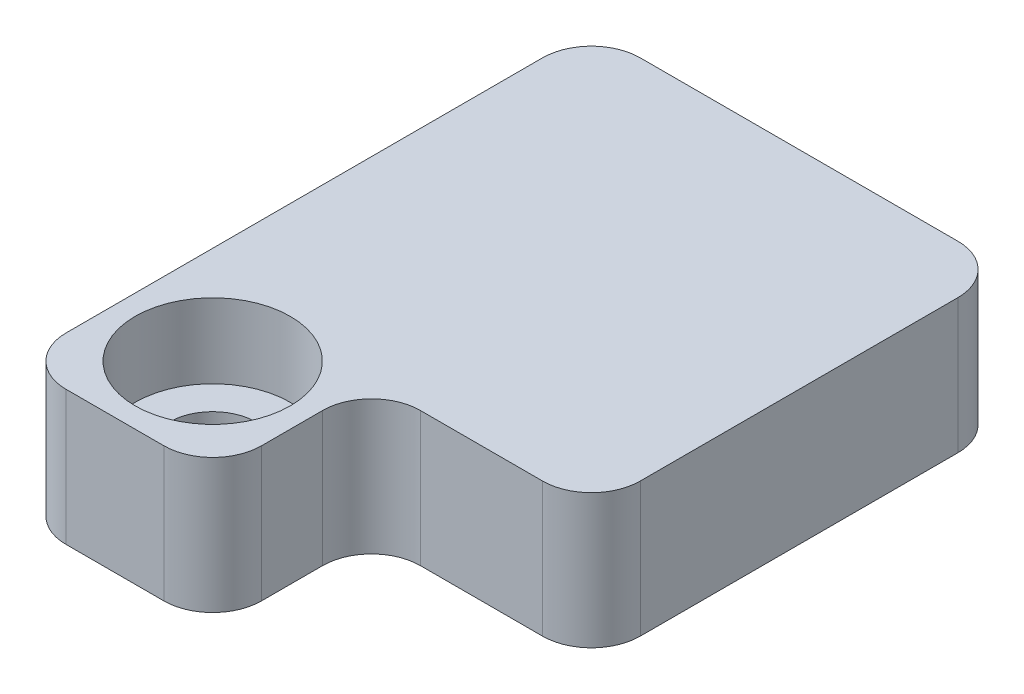
ISO-10303-21;
HEADER;
FILE_DESCRIPTION(('STEP AP214'),'2;1');
FILE_NAME('part.step','',(''),(''),'','','');
FILE_SCHEMA(('AUTOMOTIVE_DESIGN { 1 0 10303 214 1 1 1 1 }'));
ENDSEC;
DATA;
#1=APPLICATION_CONTEXT('core data for automotive mechanical design processes');
#2=APPLICATION_PROTOCOL_DEFINITION('international standard','automotive_design',2000,#1);
#3=PRODUCT_CONTEXT('',#1,'mechanical');
#4=PRODUCT('Part','Part','',(#3));
#5=PRODUCT_RELATED_PRODUCT_CATEGORY('part','',(#4));
#6=PRODUCT_DEFINITION_FORMATION('','',#4);
#7=PRODUCT_DEFINITION_CONTEXT('part definition',#1,'design');
#8=PRODUCT_DEFINITION('design','',#6,#7);
#9=PRODUCT_DEFINITION_SHAPE('','',#8);
#10=(LENGTH_UNIT() NAMED_UNIT(*) SI_UNIT(.MILLI.,.METRE.));
#11=(NAMED_UNIT(*) PLANE_ANGLE_UNIT() SI_UNIT($,.RADIAN.));
#12=(NAMED_UNIT(*) SI_UNIT($,.STERADIAN.) SOLID_ANGLE_UNIT());
#13=UNCERTAINTY_MEASURE_WITH_UNIT(LENGTH_MEASURE(1.E-05),#10,'distance_accuracy_value','');
#14=(GEOMETRIC_REPRESENTATION_CONTEXT(3) GLOBAL_UNCERTAINTY_ASSIGNED_CONTEXT((#13)) GLOBAL_UNIT_ASSIGNED_CONTEXT((#10,
#11,#12)) REPRESENTATION_CONTEXT('',''));
#15=CARTESIAN_POINT('',(0.,0.,0.));
#16=DIRECTION('',(0.,0.,1.));
#17=DIRECTION('',(1.,0.,0.));
#18=AXIS2_PLACEMENT_3D('',#15,#16,#17);
#19=CARTESIAN_POINT('',(-4.25,2.75,4.25));
#20=DIRECTION('',(0.,0.,-1.));
#21=DIRECTION('',(-1.,0.,0.));
#22=AXIS2_PLACEMENT_3D('',#19,#20,#21);
#23=PLANE('',#22);
#24=DIRECTION('',(1.,0.,0.));
#25=VECTOR('',#24,1.);
#26=CARTESIAN_POINT('',(-4.25,2.75,4.25));
#27=LINE('',#26,#25);
#28=CARTESIAN_POINT('',(0.749999999999997,2.75,4.25));
#29=VERTEX_POINT('',#28);
#30=CARTESIAN_POINT('',(3.25,2.75,4.25));
#31=VERTEX_POINT('',#30);
#32=EDGE_CURVE('E221',#29,#31,#27,.T.);
#33=ORIENTED_EDGE('',*,*,#32,.F.);
#34=DIRECTION('',(0.,1.,0.));
#35=VECTOR('',#34,1.);
#36=CARTESIAN_POINT('',(0.749999999999998,0.,4.25));
#37=LINE('',#36,#35);
#38=CARTESIAN_POINT('',(0.749999999999998,0.,4.25));
#39=VERTEX_POINT('',#38);
#40=EDGE_CURVE('E253',#29,#39,#37,.F.);
#41=ORIENTED_EDGE('',*,*,#40,.T.);
#42=DIRECTION('',(1.,0.,0.));
#43=VECTOR('',#42,1.);
#44=CARTESIAN_POINT('',(-4.25,0.,4.25));
#45=LINE('',#44,#43);
#46=CARTESIAN_POINT('',(3.25,0.,4.25));
#47=VERTEX_POINT('',#46);
#48=EDGE_CURVE('E215',#39,#47,#45,.T.);
#49=ORIENTED_EDGE('',*,*,#48,.T.);
#50=DIRECTION('',(0.,-1.,0.));
#51=VECTOR('',#50,1.);
#52=CARTESIAN_POINT('',(3.25,2.75,4.25));
#53=LINE('',#52,#51);
#54=EDGE_CURVE('E46',#47,#31,#53,.F.);
#55=ORIENTED_EDGE('',*,*,#54,.T.);
#56=EDGE_LOOP('',(#33,#41,#49,#55));
#57=FACE_BOUND('',#56,.T.);
#58=ADVANCED_FACE('F31',(#57),#23,.F.);
#59=CARTESIAN_POINT('',(4.25,2.75,4.25));
#60=DIRECTION('',(-1.,0.,0.));
#61=DIRECTION('',(0.,0.,1.));
#62=AXIS2_PLACEMENT_3D('',#59,#60,#61);
#63=PLANE('',#62);
#64=DIRECTION('',(0.,0.,-1.));
#65=VECTOR('',#64,1.);
#66=CARTESIAN_POINT('',(4.25,0.,4.25));
#67=LINE('',#66,#65);
#68=CARTESIAN_POINT('',(4.25,0.,3.25));
#69=VERTEX_POINT('',#68);
#70=CARTESIAN_POINT('',(4.25,0.,-3.25));
#71=VERTEX_POINT('',#70);
#72=EDGE_CURVE('E224',#69,#71,#67,.T.);
#73=ORIENTED_EDGE('',*,*,#72,.T.);
#74=DIRECTION('',(0.,-1.,0.));
#75=VECTOR('',#74,1.);
#76=CARTESIAN_POINT('',(4.25,2.75,-3.25));
#77=LINE('',#76,#75);
#78=CARTESIAN_POINT('',(4.25,2.75,-3.25));
#79=VERTEX_POINT('',#78);
#80=EDGE_CURVE('E245',#71,#79,#77,.F.);
#81=ORIENTED_EDGE('',*,*,#80,.T.);
#82=DIRECTION('',(0.,0.,-1.));
#83=VECTOR('',#82,1.);
#84=CARTESIAN_POINT('',(4.25,2.75,4.25));
#85=LINE('',#84,#83);
#86=CARTESIAN_POINT('',(4.25,2.75,3.25));
#87=VERTEX_POINT('',#86);
#88=EDGE_CURVE('E211',#87,#79,#85,.T.);
#89=ORIENTED_EDGE('',*,*,#88,.F.);
#90=DIRECTION('',(0.,-1.,0.));
#91=VECTOR('',#90,1.);
#92=CARTESIAN_POINT('',(4.25,2.75,3.25));
#93=LINE('',#92,#91);
#94=EDGE_CURVE('E242',#87,#69,#93,.T.);
#95=ORIENTED_EDGE('',*,*,#94,.T.);
#96=EDGE_LOOP('',(#73,#81,#89,#95));
#97=FACE_BOUND('',#96,.T.);
#98=ADVANCED_FACE('F345',(#97),#63,.F.);
#99=CARTESIAN_POINT('',(-4.25,2.75,-4.25));
#100=DIRECTION('',(0.,0.,1.));
#101=DIRECTION('',(1.,0.,0.));
#102=AXIS2_PLACEMENT_3D('',#99,#100,#101);
#103=PLANE('',#102);
#104=DIRECTION('',(-1.,0.,0.));
#105=VECTOR('',#104,1.);
#106=CARTESIAN_POINT('',(-4.25,0.,-4.25));
#107=LINE('',#106,#105);
#108=CARTESIAN_POINT('',(3.25,0.,-4.25));
#109=VERTEX_POINT('',#108);
#110=CARTESIAN_POINT('',(-3.25,0.,-4.25));
#111=VERTEX_POINT('',#110);
#112=EDGE_CURVE('E428',#109,#111,#107,.T.);
#113=ORIENTED_EDGE('',*,*,#112,.T.);
#114=DIRECTION('',(0.,-1.,0.));
#115=VECTOR('',#114,1.);
#116=CARTESIAN_POINT('',(-3.25,2.75,-4.25));
#117=LINE('',#116,#115);
#118=CARTESIAN_POINT('',(-3.25,2.75,-4.25));
#119=VERTEX_POINT('',#118);
#120=EDGE_CURVE('E234',#111,#119,#117,.F.);
#121=ORIENTED_EDGE('',*,*,#120,.T.);
#122=DIRECTION('',(-1.,0.,0.));
#123=VECTOR('',#122,1.);
#124=CARTESIAN_POINT('',(-4.25,2.75,-4.25));
#125=LINE('',#124,#123);
#126=CARTESIAN_POINT('',(3.25,2.75,-4.25));
#127=VERTEX_POINT('',#126);
#128=EDGE_CURVE('E214',#127,#119,#125,.T.);
#129=ORIENTED_EDGE('',*,*,#128,.F.);
#130=DIRECTION('',(0.,-1.,0.));
#131=VECTOR('',#130,1.);
#132=CARTESIAN_POINT('',(3.25,2.75,-4.25));
#133=LINE('',#132,#131);
#134=EDGE_CURVE('E473',#127,#109,#133,.T.);
#135=ORIENTED_EDGE('',*,*,#134,.T.);
#136=EDGE_LOOP('',(#113,#121,#129,#135));
#137=FACE_BOUND('',#136,.T.);
#138=ADVANCED_FACE('F350',(#137),#103,.F.);
#139=CARTESIAN_POINT('',(-4.25,2.75,4.25));
#140=DIRECTION('',(1.,0.,0.));
#141=DIRECTION('',(0.,0.,-1.));
#142=AXIS2_PLACEMENT_3D('',#139,#140,#141);
#143=PLANE('',#142);
#144=DIRECTION('',(0.,0.,1.));
#145=VECTOR('',#144,1.);
#146=CARTESIAN_POINT('',(-4.25,2.75,4.25));
#147=LINE('',#146,#145);
#148=CARTESIAN_POINT('',(-4.25,2.75,-3.25));
#149=VERTEX_POINT('',#148);
#150=CARTESIAN_POINT('',(-4.25,2.75,6.5));
#151=VERTEX_POINT('',#150);
#152=EDGE_CURVE('E218',#149,#151,#147,.T.);
#153=ORIENTED_EDGE('',*,*,#152,.F.);
#154=DIRECTION('',(0.,-1.,0.));
#155=VECTOR('',#154,1.);
#156=CARTESIAN_POINT('',(-4.25,2.75,-3.25));
#157=LINE('',#156,#155);
#158=CARTESIAN_POINT('',(-4.25,0.,-3.25));
#159=VERTEX_POINT('',#158);
#160=EDGE_CURVE('E290',#149,#159,#157,.T.);
#161=ORIENTED_EDGE('',*,*,#160,.T.);
#162=DIRECTION('',(0.,0.,1.));
#163=VECTOR('',#162,1.);
#164=CARTESIAN_POINT('',(-4.25,0.,4.25));
#165=LINE('',#164,#163);
#166=CARTESIAN_POINT('',(-4.25,0.,6.5));
#167=VERTEX_POINT('',#166);
#168=EDGE_CURVE('E295',#159,#167,#165,.T.);
#169=ORIENTED_EDGE('',*,*,#168,.T.);
#170=DIRECTION('',(0.,-1.,0.));
#171=VECTOR('',#170,1.);
#172=CARTESIAN_POINT('',(-4.25,2.75,6.5));
#173=LINE('',#172,#171);
#174=EDGE_CURVE('E282',#167,#151,#173,.F.);
#175=ORIENTED_EDGE('',*,*,#174,.T.);
#176=EDGE_LOOP('',(#153,#161,#169,#175));
#177=FACE_BOUND('',#176,.T.);
#178=ADVANCED_FACE('F356',(#177),#143,.F.);
#179=CARTESIAN_POINT('',(4.25,2.75,-4.25));
#180=DIRECTION('',(0.,-1.,0.));
#181=DIRECTION('',(0.,0.,-1.));
#182=AXIS2_PLACEMENT_3D('',#179,#180,#181);
#183=PLANE('',#182);
#184=CARTESIAN_POINT('',(-2.25,2.75,5.5));
#185=DIRECTION('',(0.,1.,0.));
#186=DIRECTION('',(0.,0.,1.));
#187=AXIS2_PLACEMENT_3D('',#184,#185,#186);
#188=CIRCLE('',#187,1.5875);
#189=CARTESIAN_POINT('',(-2.25,2.75,7.0875));
#190=VERTEX_POINT('',#189);
#191=EDGE_CURVE('E411',#190,#190,#188,.T.);
#192=ORIENTED_EDGE('',*,*,#191,.F.);
#193=EDGE_LOOP('',(#192));
#194=FACE_BOUND('',#193,.T.);
#195=ORIENTED_EDGE('',*,*,#128,.T.);
#196=CARTESIAN_POINT('',(-3.25,2.75,-3.25));
#197=DIRECTION('',(0.,-1.,0.));
#198=DIRECTION('',(0.,0.,-1.));
#199=AXIS2_PLACEMENT_3D('',#196,#197,#198);
#200=CIRCLE('',#199,1.);
#201=EDGE_CURVE('E240',#119,#149,#200,.F.);
#202=ORIENTED_EDGE('',*,*,#201,.T.);
#203=ORIENTED_EDGE('',*,*,#152,.T.);
#204=CARTESIAN_POINT('',(-3.25,2.75,6.5));
#205=DIRECTION('',(0.,-1.,0.));
#206=DIRECTION('',(0.,0.,-1.));
#207=AXIS2_PLACEMENT_3D('',#204,#205,#206);
#208=CIRCLE('',#207,1.);
#209=CARTESIAN_POINT('',(-3.25,2.75,7.5));
#210=VERTEX_POINT('',#209);
#211=EDGE_CURVE('E231',#151,#210,#208,.F.);
#212=ORIENTED_EDGE('',*,*,#211,.T.);
#213=DIRECTION('',(-1.,0.,0.));
#214=VECTOR('',#213,1.);
#215=CARTESIAN_POINT('',(-4.25,2.75,7.5));
#216=LINE('',#215,#214);
#217=CARTESIAN_POINT('',(-1.25,2.75,7.5));
#218=VERTEX_POINT('',#217);
#219=EDGE_CURVE('E435',#218,#210,#216,.T.);
#220=ORIENTED_EDGE('',*,*,#219,.F.);
#221=CARTESIAN_POINT('',(-1.25,2.75,6.5));
#222=DIRECTION('',(0.,-1.,0.));
#223=DIRECTION('',(0.,0.,-1.));
#224=AXIS2_PLACEMENT_3D('',#221,#222,#223);
#225=CIRCLE('',#224,1.);
#226=CARTESIAN_POINT('',(-0.250000000000002,2.75,6.5));
#227=VERTEX_POINT('',#226);
#228=EDGE_CURVE('E233',#218,#227,#225,.F.);
#229=ORIENTED_EDGE('',*,*,#228,.T.);
#230=DIRECTION('',(0.,0.,-1.));
#231=VECTOR('',#230,1.);
#232=CARTESIAN_POINT('',(-0.250000000000002,2.75,7.5));
#233=LINE('',#232,#231);
#234=CARTESIAN_POINT('',(-0.250000000000002,2.75,5.25));
#235=VERTEX_POINT('',#234);
#236=EDGE_CURVE('E201',#227,#235,#233,.T.);
#237=ORIENTED_EDGE('',*,*,#236,.T.);
#238=CARTESIAN_POINT('',(0.749999999999998,2.75,5.25));
#239=DIRECTION('',(0.,-1.,0.));
#240=DIRECTION('',(0.,0.,-1.));
#241=AXIS2_PLACEMENT_3D('',#238,#239,#240);
#242=CIRCLE('',#241,1.);
#243=EDGE_CURVE('E39',#235,#29,#242,.T.);
#244=ORIENTED_EDGE('',*,*,#243,.T.);
#245=ORIENTED_EDGE('',*,*,#32,.T.);
#246=CARTESIAN_POINT('',(3.25,2.75,3.25));
#247=DIRECTION('',(0.,-1.,0.));
#248=DIRECTION('',(0.,0.,-1.));
#249=AXIS2_PLACEMENT_3D('',#246,#247,#248);
#250=CIRCLE('',#249,1.);
#251=EDGE_CURVE('E236',#31,#87,#250,.F.);
#252=ORIENTED_EDGE('',*,*,#251,.T.);
#253=ORIENTED_EDGE('',*,*,#88,.T.);
#254=CARTESIAN_POINT('',(3.25,2.75,-3.25));
#255=DIRECTION('',(0.,-1.,0.));
#256=DIRECTION('',(0.,0.,-1.));
#257=AXIS2_PLACEMENT_3D('',#254,#255,#256);
#258=CIRCLE('',#257,1.);
#259=EDGE_CURVE('E238',#79,#127,#258,.F.);
#260=ORIENTED_EDGE('',*,*,#259,.T.);
#261=EDGE_LOOP('',(#195,#202,#203,#212,#220,#229,#237,#244,#245,#252,#253,#260));
#262=FACE_BOUND('',#261,.T.);
#263=ADVANCED_FACE('F359',(#194,#262),#183,.F.);
#264=CARTESIAN_POINT('',(4.25,0.,-4.25));
#265=DIRECTION('',(0.,-1.,0.));
#266=DIRECTION('',(0.,0.,-1.));
#267=AXIS2_PLACEMENT_3D('',#264,#265,#266);
#268=PLANE('',#267);
#269=CARTESIAN_POINT('',(-2.25,0.,5.5));
#270=DIRECTION('',(0.,-1.,0.));
#271=DIRECTION('',(0.,0.,-1.));
#272=AXIS2_PLACEMENT_3D('',#269,#270,#271);
#273=CIRCLE('',#272,0.888999999999999);
#274=CARTESIAN_POINT('',(-2.25,0.,4.611));
#275=VERTEX_POINT('',#274);
#276=EDGE_CURVE('E303',#275,#275,#273,.T.);
#277=ORIENTED_EDGE('',*,*,#276,.F.);
#278=EDGE_LOOP('',(#277));
#279=FACE_BOUND('',#278,.T.);
#280=DIRECTION('',(0.,0.,-1.));
#281=VECTOR('',#280,1.);
#282=CARTESIAN_POINT('',(-3.9,0.,3.9));
#283=LINE('',#282,#281);
#284=CARTESIAN_POINT('',(-3.9,0.,2.9));
#285=VERTEX_POINT('',#284);
#286=CARTESIAN_POINT('',(-3.9,0.,-2.9));
#287=VERTEX_POINT('',#286);
#288=EDGE_CURVE('E184',#285,#287,#283,.T.);
#289=ORIENTED_EDGE('',*,*,#288,.F.);
#290=CARTESIAN_POINT('',(-2.9,0.,2.9));
#291=DIRECTION('',(0.,-1.,0.));
#292=DIRECTION('',(0.,0.,-1.));
#293=AXIS2_PLACEMENT_3D('',#290,#291,#292);
#294=CIRCLE('',#293,1.);
#295=CARTESIAN_POINT('',(-2.9,0.,3.9));
#296=VERTEX_POINT('',#295);
#297=EDGE_CURVE('E167',#285,#296,#294,.F.);
#298=ORIENTED_EDGE('',*,*,#297,.T.);
#299=DIRECTION('',(-1.,0.,0.));
#300=VECTOR('',#299,1.);
#301=CARTESIAN_POINT('',(3.9,0.,3.9));
#302=LINE('',#301,#300);
#303=CARTESIAN_POINT('',(2.9,0.,3.9));
#304=VERTEX_POINT('',#303);
#305=EDGE_CURVE('E209',#304,#296,#302,.T.);
#306=ORIENTED_EDGE('',*,*,#305,.F.);
#307=CARTESIAN_POINT('',(2.9,0.,2.9));
#308=DIRECTION('',(0.,-1.,0.));
#309=DIRECTION('',(0.,0.,-1.));
#310=AXIS2_PLACEMENT_3D('',#307,#308,#309);
#311=CIRCLE('',#310,1.);
#312=CARTESIAN_POINT('',(3.9,0.,2.9));
#313=VERTEX_POINT('',#312);
#314=EDGE_CURVE('E263',#304,#313,#311,.F.);
#315=ORIENTED_EDGE('',*,*,#314,.T.);
#316=DIRECTION('',(0.,0.,1.));
#317=VECTOR('',#316,1.);
#318=CARTESIAN_POINT('',(3.9,0.,-3.9));
#319=LINE('',#318,#317);
#320=CARTESIAN_POINT('',(3.9,0.,-2.9));
#321=VERTEX_POINT('',#320);
#322=EDGE_CURVE('E198',#321,#313,#319,.T.);
#323=ORIENTED_EDGE('',*,*,#322,.F.);
#324=CARTESIAN_POINT('',(2.9,0.,-2.9));
#325=DIRECTION('',(0.,-1.,0.));
#326=DIRECTION('',(0.,0.,-1.));
#327=AXIS2_PLACEMENT_3D('',#324,#325,#326);
#328=CIRCLE('',#327,1.);
#329=CARTESIAN_POINT('',(2.9,0.,-3.9));
#330=VERTEX_POINT('',#329);
#331=EDGE_CURVE('E261',#321,#330,#328,.F.);
#332=ORIENTED_EDGE('',*,*,#331,.T.);
#333=DIRECTION('',(1.,0.,0.));
#334=VECTOR('',#333,1.);
#335=CARTESIAN_POINT('',(-3.9,0.,-3.9));
#336=LINE('',#335,#334);
#337=CARTESIAN_POINT('',(-2.9,0.,-3.9));
#338=VERTEX_POINT('',#337);
#339=EDGE_CURVE('E194',#338,#330,#336,.T.);
#340=ORIENTED_EDGE('',*,*,#339,.F.);
#341=CARTESIAN_POINT('',(-2.9,0.,-2.9));
#342=DIRECTION('',(0.,-1.,0.));
#343=DIRECTION('',(0.,0.,-1.));
#344=AXIS2_PLACEMENT_3D('',#341,#342,#343);
#345=CIRCLE('',#344,1.);
#346=EDGE_CURVE('E177',#338,#287,#345,.F.);
#347=ORIENTED_EDGE('',*,*,#346,.T.);
#348=EDGE_LOOP('',(#289,#298,#306,#315,#323,#332,#340,#347));
#349=FACE_BOUND('',#348,.T.);
#350=ORIENTED_EDGE('',*,*,#168,.F.);
#351=CARTESIAN_POINT('',(-3.25,0.,-3.25));
#352=DIRECTION('',(0.,-1.,0.));
#353=DIRECTION('',(0.,0.,-1.));
#354=AXIS2_PLACEMENT_3D('',#351,#352,#353);
#355=CIRCLE('',#354,1.);
#356=EDGE_CURVE('E421',#159,#111,#355,.T.);
#357=ORIENTED_EDGE('',*,*,#356,.T.);
#358=ORIENTED_EDGE('',*,*,#112,.F.);
#359=CARTESIAN_POINT('',(3.25,0.,-3.25));
#360=DIRECTION('',(0.,-1.,0.));
#361=DIRECTION('',(0.,0.,-1.));
#362=AXIS2_PLACEMENT_3D('',#359,#360,#361);
#363=CIRCLE('',#362,1.);
#364=EDGE_CURVE('E467',#109,#71,#363,.T.);
#365=ORIENTED_EDGE('',*,*,#364,.T.);
#366=ORIENTED_EDGE('',*,*,#72,.F.);
#367=CARTESIAN_POINT('',(3.25,0.,3.25));
#368=DIRECTION('',(0.,-1.,0.));
#369=DIRECTION('',(0.,0.,-1.));
#370=AXIS2_PLACEMENT_3D('',#367,#368,#369);
#371=CIRCLE('',#370,1.);
#372=EDGE_CURVE('E464',#69,#47,#371,.T.);
#373=ORIENTED_EDGE('',*,*,#372,.T.);
#374=ORIENTED_EDGE('',*,*,#48,.F.);
#375=CARTESIAN_POINT('',(0.749999999999998,0.,5.25));
#376=DIRECTION('',(0.,-1.,0.));
#377=DIRECTION('',(0.,0.,-1.));
#378=AXIS2_PLACEMENT_3D('',#375,#376,#377);
#379=CIRCLE('',#378,1.);
#380=CARTESIAN_POINT('',(-0.250000000000002,0.,5.25));
#381=VERTEX_POINT('',#380);
#382=EDGE_CURVE('E11',#39,#381,#379,.F.);
#383=ORIENTED_EDGE('',*,*,#382,.T.);
#384=DIRECTION('',(0.,0.,-1.));
#385=VECTOR('',#384,1.);
#386=CARTESIAN_POINT('',(-0.250000000000002,0.,7.5));
#387=LINE('',#386,#385);
#388=CARTESIAN_POINT('',(-0.250000000000002,0.,6.5));
#389=VERTEX_POINT('',#388);
#390=EDGE_CURVE('E195',#389,#381,#387,.T.);
#391=ORIENTED_EDGE('',*,*,#390,.F.);
#392=CARTESIAN_POINT('',(-1.25,0.,6.5));
#393=DIRECTION('',(0.,-1.,0.));
#394=DIRECTION('',(0.,0.,-1.));
#395=AXIS2_PLACEMENT_3D('',#392,#393,#394);
#396=CIRCLE('',#395,1.);
#397=CARTESIAN_POINT('',(-1.25,0.,7.5));
#398=VERTEX_POINT('',#397);
#399=EDGE_CURVE('E455',#389,#398,#396,.T.);
#400=ORIENTED_EDGE('',*,*,#399,.T.);
#401=DIRECTION('',(1.,0.,0.));
#402=VECTOR('',#401,1.);
#403=CARTESIAN_POINT('',(-4.25,0.,7.5));
#404=LINE('',#403,#402);
#405=CARTESIAN_POINT('',(-3.25,0.,7.5));
#406=VERTEX_POINT('',#405);
#407=EDGE_CURVE('E306',#406,#398,#404,.T.);
#408=ORIENTED_EDGE('',*,*,#407,.F.);
#409=CARTESIAN_POINT('',(-3.25,0.,6.5));
#410=DIRECTION('',(0.,-1.,0.));
#411=DIRECTION('',(0.,0.,-1.));
#412=AXIS2_PLACEMENT_3D('',#409,#410,#411);
#413=CIRCLE('',#412,1.);
#414=EDGE_CURVE('E293',#406,#167,#413,.T.);
#415=ORIENTED_EDGE('',*,*,#414,.T.);
#416=EDGE_LOOP('',(#350,#357,#358,#365,#366,#373,#374,#383,#391,#400,#408,#415));
#417=FACE_BOUND('',#416,.T.);
#418=ADVANCED_FACE('F191',(#279,#349,#417),#268,.T.);
#419=CARTESIAN_POINT('',(-3.9,0.5,3.9));
#420=DIRECTION('',(-1.,0.,0.));
#421=DIRECTION('',(0.,0.,1.));
#422=AXIS2_PLACEMENT_3D('',#419,#420,#421);
#423=PLANE('',#422);
#424=DIRECTION('',(0.,0.,-1.));
#425=VECTOR('',#424,1.);
#426=CARTESIAN_POINT('',(-3.9,0.5,3.9));
#427=LINE('',#426,#425);
#428=CARTESIAN_POINT('',(-3.9,0.5,2.9));
#429=VERTEX_POINT('',#428);
#430=CARTESIAN_POINT('',(-3.9,0.5,-2.9));
#431=VERTEX_POINT('',#430);
#432=EDGE_CURVE('E187',#429,#431,#427,.T.);
#433=ORIENTED_EDGE('',*,*,#432,.F.);
#434=DIRECTION('',(0.,-1.,0.));
#435=VECTOR('',#434,1.);
#436=CARTESIAN_POINT('',(-3.9,0.,2.9));
#437=LINE('',#436,#435);
#438=EDGE_CURVE('E171',#429,#285,#437,.T.);
#439=ORIENTED_EDGE('',*,*,#438,.T.);
#440=ORIENTED_EDGE('',*,*,#288,.T.);
#441=DIRECTION('',(0.,-1.,0.));
#442=VECTOR('',#441,1.);
#443=CARTESIAN_POINT('',(-3.9,0.5,-2.9));
#444=LINE('',#443,#442);
#445=EDGE_CURVE('E189',#287,#431,#444,.F.);
#446=ORIENTED_EDGE('',*,*,#445,.T.);
#447=EDGE_LOOP('',(#433,#439,#440,#446));
#448=FACE_BOUND('',#447,.T.);
#449=ADVANCED_FACE('F183',(#448),#423,.F.);
#450=CARTESIAN_POINT('',(3.9,0.5,3.9));
#451=DIRECTION('',(0.,0.,1.));
#452=DIRECTION('',(1.,0.,0.));
#453=AXIS2_PLACEMENT_3D('',#450,#451,#452);
#454=PLANE('',#453);
#455=ORIENTED_EDGE('',*,*,#305,.T.);
#456=DIRECTION('',(0.,-1.,0.));
#457=VECTOR('',#456,1.);
#458=CARTESIAN_POINT('',(-2.9,0.5,3.9));
#459=LINE('',#458,#457);
#460=CARTESIAN_POINT('',(-2.9,0.5,3.9));
#461=VERTEX_POINT('',#460);
#462=EDGE_CURVE('E172',#296,#461,#459,.F.);
#463=ORIENTED_EDGE('',*,*,#462,.T.);
#464=DIRECTION('',(-1.,0.,0.));
#465=VECTOR('',#464,1.);
#466=CARTESIAN_POINT('',(3.9,0.5,3.9));
#467=LINE('',#466,#465);
#468=CARTESIAN_POINT('',(2.9,0.5,3.9));
#469=VERTEX_POINT('',#468);
#470=EDGE_CURVE('E204',#469,#461,#467,.T.);
#471=ORIENTED_EDGE('',*,*,#470,.F.);
#472=DIRECTION('',(0.,-1.,0.));
#473=VECTOR('',#472,1.);
#474=CARTESIAN_POINT('',(2.9,0.,3.9));
#475=LINE('',#474,#473);
#476=EDGE_CURVE('E188',#469,#304,#475,.T.);
#477=ORIENTED_EDGE('',*,*,#476,.T.);
#478=EDGE_LOOP('',(#455,#463,#471,#477));
#479=FACE_BOUND('',#478,.T.);
#480=ADVANCED_FACE('F394',(#479),#454,.F.);
#481=CARTESIAN_POINT('',(3.9,0.5,-3.9));
#482=DIRECTION('',(1.,0.,0.));
#483=DIRECTION('',(0.,0.,-1.));
#484=AXIS2_PLACEMENT_3D('',#481,#482,#483);
#485=PLANE('',#484);
#486=DIRECTION('',(0.,0.,1.));
#487=VECTOR('',#486,1.);
#488=CARTESIAN_POINT('',(3.9,0.5,-3.9));
#489=LINE('',#488,#487);
#490=CARTESIAN_POINT('',(3.9,0.5,-2.9));
#491=VERTEX_POINT('',#490);
#492=CARTESIAN_POINT('',(3.9,0.5,2.9));
#493=VERTEX_POINT('',#492);
#494=EDGE_CURVE('E330',#491,#493,#489,.T.);
#495=ORIENTED_EDGE('',*,*,#494,.F.);
#496=DIRECTION('',(0.,-1.,0.));
#497=VECTOR('',#496,1.);
#498=CARTESIAN_POINT('',(3.9,0.,-2.9));
#499=LINE('',#498,#497);
#500=EDGE_CURVE('E276',#491,#321,#499,.T.);
#501=ORIENTED_EDGE('',*,*,#500,.T.);
#502=ORIENTED_EDGE('',*,*,#322,.T.);
#503=DIRECTION('',(0.,-1.,0.));
#504=VECTOR('',#503,1.);
#505=CARTESIAN_POINT('',(3.9,0.5,2.9));
#506=LINE('',#505,#504);
#507=EDGE_CURVE('E273',#313,#493,#506,.F.);
#508=ORIENTED_EDGE('',*,*,#507,.T.);
#509=EDGE_LOOP('',(#495,#501,#502,#508));
#510=FACE_BOUND('',#509,.T.);
#511=ADVANCED_FACE('F272',(#510),#485,.F.);
#512=CARTESIAN_POINT('',(-3.9,0.5,-3.9));
#513=DIRECTION('',(0.,0.,-1.));
#514=DIRECTION('',(-1.,0.,0.));
#515=AXIS2_PLACEMENT_3D('',#512,#513,#514);
#516=PLANE('',#515);
#517=DIRECTION('',(1.,0.,0.));
#518=VECTOR('',#517,1.);
#519=CARTESIAN_POINT('',(-3.9,0.5,-3.9));
#520=LINE('',#519,#518);
#521=CARTESIAN_POINT('',(-2.9,0.5,-3.9));
#522=VERTEX_POINT('',#521);
#523=CARTESIAN_POINT('',(2.9,0.5,-3.9));
#524=VERTEX_POINT('',#523);
#525=EDGE_CURVE('E322',#522,#524,#520,.T.);
#526=ORIENTED_EDGE('',*,*,#525,.F.);
#527=DIRECTION('',(0.,-1.,0.));
#528=VECTOR('',#527,1.);
#529=CARTESIAN_POINT('',(-2.9,0.,-3.9));
#530=LINE('',#529,#528);
#531=EDGE_CURVE('E280',#522,#338,#530,.T.);
#532=ORIENTED_EDGE('',*,*,#531,.T.);
#533=ORIENTED_EDGE('',*,*,#339,.T.);
#534=DIRECTION('',(0.,-1.,0.));
#535=VECTOR('',#534,1.);
#536=CARTESIAN_POINT('',(2.9,0.5,-3.9));
#537=LINE('',#536,#535);
#538=EDGE_CURVE('E285',#330,#524,#537,.F.);
#539=ORIENTED_EDGE('',*,*,#538,.T.);
#540=EDGE_LOOP('',(#526,#532,#533,#539));
#541=FACE_BOUND('',#540,.T.);
#542=ADVANCED_FACE('F321',(#541),#516,.F.);
#543=CARTESIAN_POINT('',(-3.9,0.5,-3.9));
#544=DIRECTION('',(0.,-1.,0.));
#545=DIRECTION('',(0.,0.,-1.));
#546=AXIS2_PLACEMENT_3D('',#543,#544,#545);
#547=PLANE('',#546);
#548=ORIENTED_EDGE('',*,*,#470,.T.);
#549=CARTESIAN_POINT('',(-2.9,0.5,2.9));
#550=DIRECTION('',(0.,-1.,0.));
#551=DIRECTION('',(0.,0.,-1.));
#552=AXIS2_PLACEMENT_3D('',#549,#550,#551);
#553=CIRCLE('',#552,1.);
#554=EDGE_CURVE('E316',#461,#429,#553,.T.);
#555=ORIENTED_EDGE('',*,*,#554,.T.);
#556=ORIENTED_EDGE('',*,*,#432,.T.);
#557=CARTESIAN_POINT('',(-2.9,0.5,-2.9));
#558=DIRECTION('',(0.,-1.,0.));
#559=DIRECTION('',(0.,0.,-1.));
#560=AXIS2_PLACEMENT_3D('',#557,#558,#559);
#561=CIRCLE('',#560,1.);
#562=EDGE_CURVE('E314',#431,#522,#561,.T.);
#563=ORIENTED_EDGE('',*,*,#562,.T.);
#564=ORIENTED_EDGE('',*,*,#525,.T.);
#565=CARTESIAN_POINT('',(2.9,0.5,-2.9));
#566=DIRECTION('',(0.,-1.,0.));
#567=DIRECTION('',(0.,0.,-1.));
#568=AXIS2_PLACEMENT_3D('',#565,#566,#567);
#569=CIRCLE('',#568,1.);
#570=EDGE_CURVE('E312',#524,#491,#569,.T.);
#571=ORIENTED_EDGE('',*,*,#570,.T.);
#572=ORIENTED_EDGE('',*,*,#494,.T.);
#573=CARTESIAN_POINT('',(2.9,0.5,2.9));
#574=DIRECTION('',(0.,-1.,0.));
#575=DIRECTION('',(0.,0.,-1.));
#576=AXIS2_PLACEMENT_3D('',#573,#574,#575);
#577=CIRCLE('',#576,1.);
#578=EDGE_CURVE('E279',#493,#469,#577,.T.);
#579=ORIENTED_EDGE('',*,*,#578,.T.);
#580=EDGE_LOOP('',(#548,#555,#556,#563,#564,#571,#572,#579));
#581=FACE_BOUND('',#580,.T.);
#582=ADVANCED_FACE('F328',(#581),#547,.T.);
#583=CARTESIAN_POINT('',(-0.250000000000002,2.75,7.5));
#584=DIRECTION('',(-1.,0.,0.));
#585=DIRECTION('',(0.,-1.,0.));
#586=AXIS2_PLACEMENT_3D('',#583,#584,#585);
#587=PLANE('',#586);
#588=ORIENTED_EDGE('',*,*,#390,.T.);
#589=DIRECTION('',(0.,1.,0.));
#590=VECTOR('',#589,1.);
#591=CARTESIAN_POINT('',(-0.250000000000002,2.75,5.25));
#592=LINE('',#591,#590);
#593=EDGE_CURVE('E249',#381,#235,#592,.T.);
#594=ORIENTED_EDGE('',*,*,#593,.T.);
#595=ORIENTED_EDGE('',*,*,#236,.F.);
#596=DIRECTION('',(0.,1.,0.));
#597=VECTOR('',#596,1.);
#598=CARTESIAN_POINT('',(-0.250000000000002,0.,6.5));
#599=LINE('',#598,#597);
#600=EDGE_CURVE('E247',#227,#389,#599,.F.);
#601=ORIENTED_EDGE('',*,*,#600,.T.);
#602=EDGE_LOOP('',(#588,#594,#595,#601));
#603=FACE_BOUND('',#602,.T.);
#604=ADVANCED_FACE('F387',(#603),#587,.F.);
#605=CARTESIAN_POINT('',(-4.25,0.,7.5));
#606=DIRECTION('',(0.,0.,1.));
#607=DIRECTION('',(1.,0.,0.));
#608=AXIS2_PLACEMENT_3D('',#605,#606,#607);
#609=PLANE('',#608);
#610=ORIENTED_EDGE('',*,*,#407,.T.);
#611=DIRECTION('',(0.,1.,0.));
#612=VECTOR('',#611,1.);
#613=CARTESIAN_POINT('',(-1.25,2.75,7.5));
#614=LINE('',#613,#612);
#615=EDGE_CURVE('E178',#398,#218,#614,.T.);
#616=ORIENTED_EDGE('',*,*,#615,.T.);
#617=ORIENTED_EDGE('',*,*,#219,.T.);
#618=DIRECTION('',(0.,-1.,0.));
#619=VECTOR('',#618,1.);
#620=CARTESIAN_POINT('',(-3.25,0.,7.5));
#621=LINE('',#620,#619);
#622=EDGE_CURVE('E255',#210,#406,#621,.T.);
#623=ORIENTED_EDGE('',*,*,#622,.T.);
#624=EDGE_LOOP('',(#610,#616,#617,#623));
#625=FACE_BOUND('',#624,.T.);
#626=ADVANCED_FACE('F383',(#625),#609,.T.);
#627=CARTESIAN_POINT('',(-2.25,2.75,5.5));
#628=DIRECTION('',(0.,1.,0.));
#629=DIRECTION('',(0.,0.,1.));
#630=AXIS2_PLACEMENT_3D('',#627,#628,#629);
#631=CYLINDRICAL_SURFACE('',#630,0.888999999999999);
#632=ORIENTED_EDGE('',*,*,#276,.T.);
#633=EDGE_LOOP('',(#632));
#634=FACE_BOUND('',#633,.T.);
#635=CARTESIAN_POINT('',(-2.25,1.226,5.5));
#636=DIRECTION('',(0.,1.,0.));
#637=DIRECTION('',(0.,0.,1.));
#638=AXIS2_PLACEMENT_3D('',#635,#636,#637);
#639=CIRCLE('',#638,0.889);
#640=CARTESIAN_POINT('',(-2.25,1.226,6.389));
#641=VERTEX_POINT('',#640);
#642=EDGE_CURVE('E307',#641,#641,#639,.T.);
#643=ORIENTED_EDGE('',*,*,#642,.T.);
#644=EDGE_LOOP('',(#643));
#645=FACE_BOUND('',#644,.T.);
#646=ADVANCED_FACE('F375',(#634,#645),#631,.F.);
#647=CARTESIAN_POINT('',(-1.361,1.226,5.5));
#648=DIRECTION('',(0.,-1.,0.));
#649=DIRECTION('',(0.,0.,-1.));
#650=AXIS2_PLACEMENT_3D('',#647,#648,#649);
#651=PLANE('',#650);
#652=ORIENTED_EDGE('',*,*,#642,.F.);
#653=EDGE_LOOP('',(#652));
#654=FACE_BOUND('',#653,.T.);
#655=CARTESIAN_POINT('',(-2.25,1.226,5.5));
#656=DIRECTION('',(0.,1.,0.));
#657=DIRECTION('',(0.,0.,1.));
#658=AXIS2_PLACEMENT_3D('',#655,#656,#657);
#659=CIRCLE('',#658,1.5875);
#660=CARTESIAN_POINT('',(-2.25,1.226,7.0875));
#661=VERTEX_POINT('',#660);
#662=EDGE_CURVE('E442',#661,#661,#659,.T.);
#663=ORIENTED_EDGE('',*,*,#662,.T.);
#664=EDGE_LOOP('',(#663));
#665=FACE_BOUND('',#664,.T.);
#666=ADVANCED_FACE('F369',(#654,#665),#651,.F.);
#667=CARTESIAN_POINT('',(-2.25,2.75,5.5));
#668=DIRECTION('',(0.,1.,0.));
#669=DIRECTION('',(0.,0.,1.));
#670=AXIS2_PLACEMENT_3D('',#667,#668,#669);
#671=CYLINDRICAL_SURFACE('',#670,1.5875);
#672=ORIENTED_EDGE('',*,*,#662,.F.);
#673=EDGE_LOOP('',(#672));
#674=FACE_BOUND('',#673,.T.);
#675=ORIENTED_EDGE('',*,*,#191,.T.);
#676=EDGE_LOOP('',(#675));
#677=FACE_BOUND('',#676,.T.);
#678=ADVANCED_FACE('F365',(#674,#677),#671,.F.);
#679=CARTESIAN_POINT('',(-2.9,0.5,2.9));
#680=DIRECTION('',(0.,1.,0.));
#681=DIRECTION('',(0.,0.,1.));
#682=AXIS2_PLACEMENT_3D('',#679,#680,#681);
#683=CYLINDRICAL_SURFACE('',#682,1.);
#684=ORIENTED_EDGE('',*,*,#554,.F.);
#685=ORIENTED_EDGE('',*,*,#462,.F.);
#686=ORIENTED_EDGE('',*,*,#297,.F.);
#687=ORIENTED_EDGE('',*,*,#438,.F.);
#688=EDGE_LOOP('',(#684,#685,#686,#687));
#689=FACE_BOUND('',#688,.T.);
#690=ADVANCED_FACE('F170',(#689),#683,.F.);
#691=CARTESIAN_POINT('',(-2.9,0.5,-2.9));
#692=DIRECTION('',(0.,1.,0.));
#693=DIRECTION('',(0.,0.,1.));
#694=AXIS2_PLACEMENT_3D('',#691,#692,#693);
#695=CYLINDRICAL_SURFACE('',#694,1.);
#696=ORIENTED_EDGE('',*,*,#562,.F.);
#697=ORIENTED_EDGE('',*,*,#445,.F.);
#698=ORIENTED_EDGE('',*,*,#346,.F.);
#699=ORIENTED_EDGE('',*,*,#531,.F.);
#700=EDGE_LOOP('',(#696,#697,#698,#699));
#701=FACE_BOUND('',#700,.T.);
#702=ADVANCED_FACE('F334',(#701),#695,.F.);
#703=CARTESIAN_POINT('',(2.9,0.5,-2.9));
#704=DIRECTION('',(0.,1.,0.));
#705=DIRECTION('',(0.,0.,1.));
#706=AXIS2_PLACEMENT_3D('',#703,#704,#705);
#707=CYLINDRICAL_SURFACE('',#706,1.);
#708=ORIENTED_EDGE('',*,*,#570,.F.);
#709=ORIENTED_EDGE('',*,*,#538,.F.);
#710=ORIENTED_EDGE('',*,*,#331,.F.);
#711=ORIENTED_EDGE('',*,*,#500,.F.);
#712=EDGE_LOOP('',(#708,#709,#710,#711));
#713=FACE_BOUND('',#712,.T.);
#714=ADVANCED_FACE('F332',(#713),#707,.F.);
#715=CARTESIAN_POINT('',(2.9,0.5,2.9));
#716=DIRECTION('',(0.,1.,0.));
#717=DIRECTION('',(0.,0.,1.));
#718=AXIS2_PLACEMENT_3D('',#715,#716,#717);
#719=CYLINDRICAL_SURFACE('',#718,1.);
#720=ORIENTED_EDGE('',*,*,#578,.F.);
#721=ORIENTED_EDGE('',*,*,#507,.F.);
#722=ORIENTED_EDGE('',*,*,#314,.F.);
#723=ORIENTED_EDGE('',*,*,#476,.F.);
#724=EDGE_LOOP('',(#720,#721,#722,#723));
#725=FACE_BOUND('',#724,.T.);
#726=ADVANCED_FACE('F278',(#725),#719,.F.);
#727=CARTESIAN_POINT('',(-3.25,2.75,-3.25));
#728=DIRECTION('',(0.,-1.,0.));
#729=DIRECTION('',(0.,0.,-1.));
#730=AXIS2_PLACEMENT_3D('',#727,#728,#729);
#731=CYLINDRICAL_SURFACE('',#730,1.);
#732=ORIENTED_EDGE('',*,*,#201,.F.);
#733=ORIENTED_EDGE('',*,*,#120,.F.);
#734=ORIENTED_EDGE('',*,*,#356,.F.);
#735=ORIENTED_EDGE('',*,*,#160,.F.);
#736=EDGE_LOOP('',(#732,#733,#734,#735));
#737=FACE_BOUND('',#736,.T.);
#738=ADVANCED_FACE('F340',(#737),#731,.T.);
#739=CARTESIAN_POINT('',(3.25,2.75,-3.25));
#740=DIRECTION('',(0.,-1.,0.));
#741=DIRECTION('',(0.,0.,-1.));
#742=AXIS2_PLACEMENT_3D('',#739,#740,#741);
#743=CYLINDRICAL_SURFACE('',#742,1.);
#744=ORIENTED_EDGE('',*,*,#259,.F.);
#745=ORIENTED_EDGE('',*,*,#80,.F.);
#746=ORIENTED_EDGE('',*,*,#364,.F.);
#747=ORIENTED_EDGE('',*,*,#134,.F.);
#748=EDGE_LOOP('',(#744,#745,#746,#747));
#749=FACE_BOUND('',#748,.T.);
#750=ADVANCED_FACE('F475',(#749),#743,.T.);
#751=CARTESIAN_POINT('',(0.749999999999998,2.75,5.25));
#752=DIRECTION('',(0.,-1.,0.));
#753=DIRECTION('',(1.,0.,0.));
#754=AXIS2_PLACEMENT_3D('',#751,#752,#753);
#755=CYLINDRICAL_SURFACE('',#754,1.);
#756=ORIENTED_EDGE('',*,*,#382,.F.);
#757=ORIENTED_EDGE('',*,*,#40,.F.);
#758=ORIENTED_EDGE('',*,*,#243,.F.);
#759=ORIENTED_EDGE('',*,*,#593,.F.);
#760=EDGE_LOOP('',(#756,#757,#758,#759));
#761=FACE_BOUND('',#760,.T.);
#762=ADVANCED_FACE('F461',(#761),#755,.F.);
#763=CARTESIAN_POINT('',(3.25,2.75,3.25));
#764=DIRECTION('',(0.,-1.,0.));
#765=DIRECTION('',(0.,0.,-1.));
#766=AXIS2_PLACEMENT_3D('',#763,#764,#765);
#767=CYLINDRICAL_SURFACE('',#766,1.);
#768=ORIENTED_EDGE('',*,*,#251,.F.);
#769=ORIENTED_EDGE('',*,*,#54,.F.);
#770=ORIENTED_EDGE('',*,*,#372,.F.);
#771=ORIENTED_EDGE('',*,*,#94,.F.);
#772=EDGE_LOOP('',(#768,#769,#770,#771));
#773=FACE_BOUND('',#772,.T.);
#774=ADVANCED_FACE('F478',(#773),#767,.T.);
#775=CARTESIAN_POINT('',(-1.25,0.,6.5));
#776=DIRECTION('',(0.,-1.,0.));
#777=DIRECTION('',(1.,0.,0.));
#778=AXIS2_PLACEMENT_3D('',#775,#776,#777);
#779=CYLINDRICAL_SURFACE('',#778,1.);
#780=ORIENTED_EDGE('',*,*,#399,.F.);
#781=ORIENTED_EDGE('',*,*,#600,.F.);
#782=ORIENTED_EDGE('',*,*,#228,.F.);
#783=ORIENTED_EDGE('',*,*,#615,.F.);
#784=EDGE_LOOP('',(#780,#781,#782,#783));
#785=FACE_BOUND('',#784,.T.);
#786=ADVANCED_FACE('F453',(#785),#779,.T.);
#787=CARTESIAN_POINT('',(-3.25,0.,6.5));
#788=DIRECTION('',(0.,1.,0.));
#789=DIRECTION('',(0.,0.,1.));
#790=AXIS2_PLACEMENT_3D('',#787,#788,#789);
#791=CYLINDRICAL_SURFACE('',#790,1.);
#792=ORIENTED_EDGE('',*,*,#211,.F.);
#793=ORIENTED_EDGE('',*,*,#174,.F.);
#794=ORIENTED_EDGE('',*,*,#414,.F.);
#795=ORIENTED_EDGE('',*,*,#622,.F.);
#796=EDGE_LOOP('',(#792,#793,#794,#795));
#797=FACE_BOUND('',#796,.T.);
#798=ADVANCED_FACE('F33',(#797),#791,.T.);
#799=CLOSED_SHELL('',(#58,#98,#138,#178,#263,#418,#449,#480,#511,#542,#582,#604,#626,#646,#666,
#678,#690,#702,#714,#726,#738,#750,#762,#774,#786,#798));
#800=MANIFOLD_SOLID_BREP('B2',#799);
#801=ADVANCED_BREP_SHAPE_REPRESENTATION('',(#18,#800),#14);
#802=SHAPE_DEFINITION_REPRESENTATION(#9,#801);
ENDSEC;
END-ISO-10303-21;
